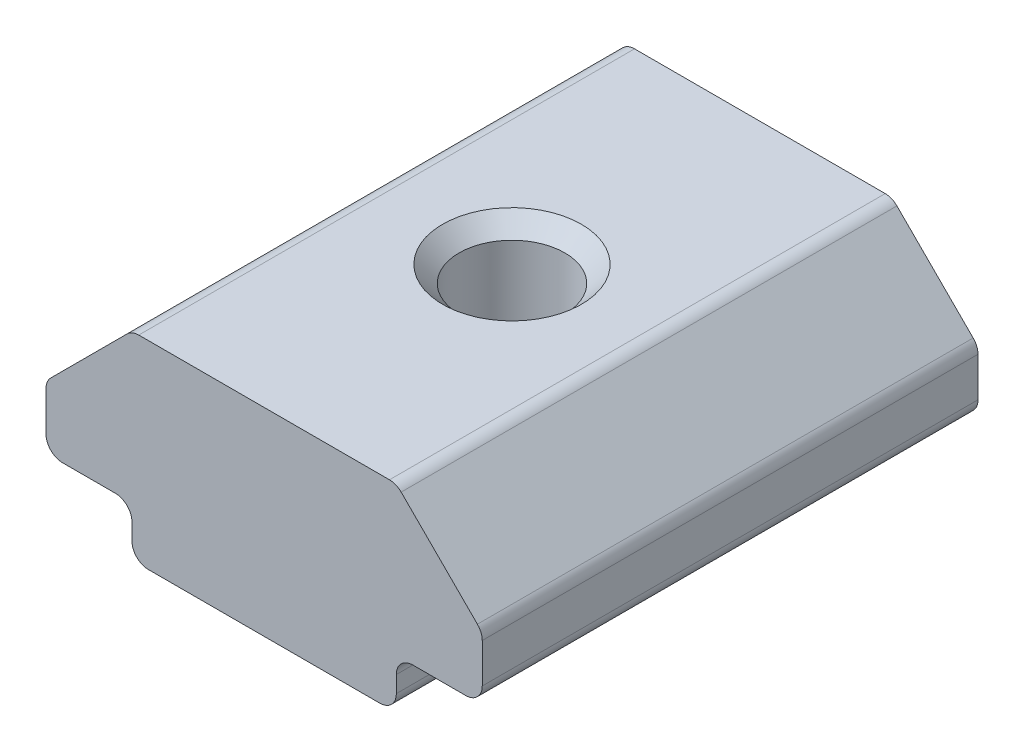
ISO-10303-21;
HEADER;
FILE_DESCRIPTION(('STEP AP214'),'2;1');
FILE_NAME('part.step','',(''),(''),'','','');
FILE_SCHEMA(('AUTOMOTIVE_DESIGN { 1 0 10303 214 1 1 1 1 }'));
ENDSEC;
DATA;
#1=APPLICATION_CONTEXT('core data for automotive mechanical design processes');
#2=APPLICATION_PROTOCOL_DEFINITION('international standard','automotive_design',2000,#1);
#3=PRODUCT_CONTEXT('',#1,'mechanical');
#4=PRODUCT('Part','Part','',(#3));
#5=PRODUCT_RELATED_PRODUCT_CATEGORY('part','',(#4));
#6=PRODUCT_DEFINITION_FORMATION('','',#4);
#7=PRODUCT_DEFINITION_CONTEXT('part definition',#1,'design');
#8=PRODUCT_DEFINITION('design','',#6,#7);
#9=PRODUCT_DEFINITION_SHAPE('','',#8);
#10=(LENGTH_UNIT() NAMED_UNIT(*) SI_UNIT(.MILLI.,.METRE.));
#11=(NAMED_UNIT(*) PLANE_ANGLE_UNIT() SI_UNIT($,.RADIAN.));
#12=(NAMED_UNIT(*) SI_UNIT($,.STERADIAN.) SOLID_ANGLE_UNIT());
#13=UNCERTAINTY_MEASURE_WITH_UNIT(LENGTH_MEASURE(1.E-05),#10,'distance_accuracy_value','');
#14=(GEOMETRIC_REPRESENTATION_CONTEXT(3) GLOBAL_UNCERTAINTY_ASSIGNED_CONTEXT((#13)) GLOBAL_UNIT_ASSIGNED_CONTEXT((#10,
#11,#12)) REPRESENTATION_CONTEXT('',''));
#15=CARTESIAN_POINT('',(0.,0.,0.));
#16=DIRECTION('',(0.,0.,1.));
#17=DIRECTION('',(1.,0.,0.));
#18=AXIS2_PLACEMENT_3D('',#15,#16,#17);
#19=CARTESIAN_POINT('',(-5.75128491827081,2.39950170301745,5.35241694229398));
#20=DIRECTION('',(1.,0.,0.));
#21=DIRECTION('',(0.,0.,-1.));
#22=AXIS2_PLACEMENT_3D('',#19,#20,#21);
#23=PLANE('',#22);
#24=DIRECTION('',(0.,-1.,0.));
#25=VECTOR('',#24,1.);
#26=CARTESIAN_POINT('',(-5.75128491827081,2.39950170301745,5.35241694229398));
#27=LINE('',#26,#25);
#28=CARTESIAN_POINT('',(-5.75128491827081,1.89950170301745,5.35241694229398));
#29=VERTEX_POINT('',#28);
#30=CARTESIAN_POINT('',(-5.75128491827081,1.39950170301745,5.35241694229398));
#31=VERTEX_POINT('',#30);
#32=EDGE_CURVE('E204',#29,#31,#27,.T.);
#33=ORIENTED_EDGE('',*,*,#32,.F.);
#34=DIRECTION('',(0.,0.,-1.));
#35=VECTOR('',#34,1.);
#36=CARTESIAN_POINT('',(-5.75128491827081,1.89950170301745,-9.64758305770602));
#37=LINE('',#36,#35);
#38=CARTESIAN_POINT('',(-5.75128491827081,1.89950170301745,-9.64758305770602));
#39=VERTEX_POINT('',#38);
#40=EDGE_CURVE('E288',#29,#39,#37,.T.);
#41=ORIENTED_EDGE('',*,*,#40,.T.);
#42=DIRECTION('',(0.,-1.,0.));
#43=VECTOR('',#42,1.);
#44=CARTESIAN_POINT('',(-5.75128491827081,2.39950170301745,-9.64758305770602));
#45=LINE('',#44,#43);
#46=CARTESIAN_POINT('',(-5.75128491827081,1.39950170301745,-9.64758305770602));
#47=VERTEX_POINT('',#46);
#48=EDGE_CURVE('E178',#39,#47,#45,.T.);
#49=ORIENTED_EDGE('',*,*,#48,.T.);
#50=DIRECTION('',(0.,0.,-1.));
#51=VECTOR('',#50,1.);
#52=CARTESIAN_POINT('',(-5.75128491827081,1.39950170301745,5.35241694229398));
#53=LINE('',#52,#51);
#54=EDGE_CURVE('E160',#47,#31,#53,.F.);
#55=ORIENTED_EDGE('',*,*,#54,.T.);
#56=EDGE_LOOP('',(#33,#41,#49,#55));
#57=FACE_BOUND('',#56,.T.);
#58=ADVANCED_FACE('F16',(#57),#23,.F.);
#59=CARTESIAN_POINT('',(-5.75128491827081,0.899501703017449,5.35241694229398));
#60=DIRECTION('',(0.,1.,0.));
#61=DIRECTION('',(0.,0.,1.));
#62=AXIS2_PLACEMENT_3D('',#59,#60,#61);
#63=PLANE('',#62);
#64=CARTESIAN_POINT('',(-1.75128491827081,0.899501703017449,-2.14758305770602));
#65=DIRECTION('',(0.,1.,0.));
#66=DIRECTION('',(0.,0.,1.));
#67=AXIS2_PLACEMENT_3D('',#64,#65,#66);
#68=CIRCLE('',#67,2.1);
#69=CARTESIAN_POINT('',(-1.75128491827081,0.899501703017449,-0.0475830577060157));
#70=VERTEX_POINT('',#69);
#71=EDGE_CURVE('E271',#70,#70,#68,.T.);
#72=ORIENTED_EDGE('',*,*,#71,.T.);
#73=EDGE_LOOP('',(#72));
#74=FACE_BOUND('',#73,.T.);
#75=DIRECTION('',(1.,0.,0.));
#76=VECTOR('',#75,1.);
#77=CARTESIAN_POINT('',(-5.75128491827081,0.899501703017449,5.35241694229398));
#78=LINE('',#77,#76);
#79=CARTESIAN_POINT('',(-5.25128491827081,0.899501703017449,5.35241694229398));
#80=VERTEX_POINT('',#79);
#81=CARTESIAN_POINT('',(1.74871508172919,0.899501703017449,5.35241694229398));
#82=VERTEX_POINT('',#81);
#83=EDGE_CURVE('E171',#80,#82,#78,.T.);
#84=ORIENTED_EDGE('',*,*,#83,.F.);
#85=DIRECTION('',(0.,0.,-1.));
#86=VECTOR('',#85,1.);
#87=CARTESIAN_POINT('',(-5.25128491827081,0.899501703017449,5.35241694229398));
#88=LINE('',#87,#86);
#89=CARTESIAN_POINT('',(-5.25128491827081,0.899501703017449,-9.64758305770602));
#90=VERTEX_POINT('',#89);
#91=EDGE_CURVE('E158',#80,#90,#88,.T.);
#92=ORIENTED_EDGE('',*,*,#91,.T.);
#93=DIRECTION('',(1.,0.,0.));
#94=VECTOR('',#93,1.);
#95=CARTESIAN_POINT('',(-5.75128491827081,0.899501703017449,-9.64758305770602));
#96=LINE('',#95,#94);
#97=CARTESIAN_POINT('',(1.74871508172919,0.899501703017449,-9.64758305770602));
#98=VERTEX_POINT('',#97);
#99=EDGE_CURVE('E168',#90,#98,#96,.T.);
#100=ORIENTED_EDGE('',*,*,#99,.T.);
#101=DIRECTION('',(0.,0.,-1.));
#102=VECTOR('',#101,1.);
#103=CARTESIAN_POINT('',(1.74871508172919,0.899501703017449,5.35241694229398));
#104=LINE('',#103,#102);
#105=EDGE_CURVE('E173',#98,#82,#104,.F.);
#106=ORIENTED_EDGE('',*,*,#105,.T.);
#107=EDGE_LOOP('',(#84,#92,#100,#106));
#108=FACE_BOUND('',#107,.T.);
#109=ADVANCED_FACE('F167',(#74,#108),#63,.F.);
#110=CARTESIAN_POINT('',(2.24871508172919,0.899501703017449,5.35241694229398));
#111=DIRECTION('',(-1.,0.,0.));
#112=DIRECTION('',(0.,0.,1.));
#113=AXIS2_PLACEMENT_3D('',#110,#111,#112);
#114=PLANE('',#113);
#115=DIRECTION('',(0.,1.,0.));
#116=VECTOR('',#115,1.);
#117=CARTESIAN_POINT('',(2.24871508172919,0.899501703017449,-9.64758305770602));
#118=LINE('',#117,#116);
#119=CARTESIAN_POINT('',(2.24871508172919,1.39950170301745,-9.64758305770602));
#120=VERTEX_POINT('',#119);
#121=CARTESIAN_POINT('',(2.24871508172919,1.89950170301745,-9.64758305770602));
#122=VERTEX_POINT('',#121);
#123=EDGE_CURVE('E177',#120,#122,#118,.T.);
#124=ORIENTED_EDGE('',*,*,#123,.T.);
#125=DIRECTION('',(0.,0.,-1.));
#126=VECTOR('',#125,1.);
#127=CARTESIAN_POINT('',(2.24871508172919,1.89950170301745,5.35241694229398));
#128=LINE('',#127,#126);
#129=CARTESIAN_POINT('',(2.24871508172919,1.89950170301745,5.35241694229398));
#130=VERTEX_POINT('',#129);
#131=EDGE_CURVE('E286',#122,#130,#128,.F.);
#132=ORIENTED_EDGE('',*,*,#131,.T.);
#133=DIRECTION('',(0.,1.,0.));
#134=VECTOR('',#133,1.);
#135=CARTESIAN_POINT('',(2.24871508172919,0.899501703017449,5.35241694229398));
#136=LINE('',#135,#134);
#137=CARTESIAN_POINT('',(2.24871508172919,1.39950170301745,5.35241694229398));
#138=VERTEX_POINT('',#137);
#139=EDGE_CURVE('E302',#138,#130,#136,.T.);
#140=ORIENTED_EDGE('',*,*,#139,.F.);
#141=DIRECTION('',(0.,0.,-1.));
#142=VECTOR('',#141,1.);
#143=CARTESIAN_POINT('',(2.24871508172919,1.39950170301745,5.35241694229398));
#144=LINE('',#143,#142);
#145=EDGE_CURVE('E268',#138,#120,#144,.T.);
#146=ORIENTED_EDGE('',*,*,#145,.T.);
#147=EDGE_LOOP('',(#124,#132,#140,#146));
#148=FACE_BOUND('',#147,.T.);
#149=ADVANCED_FACE('F315',(#148),#114,.F.);
#150=CARTESIAN_POINT('',(2.24871508172919,2.39950170301745,5.35241694229398));
#151=DIRECTION('',(0.,1.,0.));
#152=DIRECTION('',(0.,0.,1.));
#153=AXIS2_PLACEMENT_3D('',#150,#151,#152);
#154=PLANE('',#153);
#155=DIRECTION('',(1.,0.,0.));
#156=VECTOR('',#155,1.);
#157=CARTESIAN_POINT('',(2.24871508172919,2.39950170301745,5.35241694229398));
#158=LINE('',#157,#156);
#159=CARTESIAN_POINT('',(2.74871508172919,2.39950170301745,5.35241694229398));
#160=VERTEX_POINT('',#159);
#161=CARTESIAN_POINT('',(4.34871508172919,2.39950170301745,5.35241694229398));
#162=VERTEX_POINT('',#161);
#163=EDGE_CURVE('E300',#160,#162,#158,.T.);
#164=ORIENTED_EDGE('',*,*,#163,.F.);
#165=DIRECTION('',(0.,0.,-1.));
#166=VECTOR('',#165,1.);
#167=CARTESIAN_POINT('',(2.74871508172919,2.39950170301745,-9.64758305770602));
#168=LINE('',#167,#166);
#169=CARTESIAN_POINT('',(2.74871508172919,2.39950170301745,-9.64758305770602));
#170=VERTEX_POINT('',#169);
#171=EDGE_CURVE('E283',#160,#170,#168,.T.);
#172=ORIENTED_EDGE('',*,*,#171,.T.);
#173=DIRECTION('',(1.,0.,0.));
#174=VECTOR('',#173,1.);
#175=CARTESIAN_POINT('',(2.24871508172919,2.39950170301745,-9.64758305770602));
#176=LINE('',#175,#174);
#177=CARTESIAN_POINT('',(4.34871508172919,2.39950170301745,-9.64758305770602));
#178=VERTEX_POINT('',#177);
#179=EDGE_CURVE('E181',#170,#178,#176,.T.);
#180=ORIENTED_EDGE('',*,*,#179,.T.);
#181=DIRECTION('',(0.,0.,-1.));
#182=VECTOR('',#181,1.);
#183=CARTESIAN_POINT('',(4.34871508172919,2.39950170301745,5.35241694229398));
#184=LINE('',#183,#182);
#185=EDGE_CURVE('E265',#178,#162,#184,.F.);
#186=ORIENTED_EDGE('',*,*,#185,.T.);
#187=EDGE_LOOP('',(#164,#172,#180,#186));
#188=FACE_BOUND('',#187,.T.);
#189=ADVANCED_FACE('F307',(#188),#154,.F.);
#190=CARTESIAN_POINT('',(4.84871508172919,2.39950170301745,5.35241694229398));
#191=DIRECTION('',(-1.,0.,0.));
#192=DIRECTION('',(0.,0.,1.));
#193=AXIS2_PLACEMENT_3D('',#190,#191,#192);
#194=PLANE('',#193);
#195=DIRECTION('',(0.,1.,0.));
#196=VECTOR('',#195,1.);
#197=CARTESIAN_POINT('',(4.84871508172919,2.39950170301745,-9.64758305770602));
#198=LINE('',#197,#196);
#199=CARTESIAN_POINT('',(4.84871508172919,2.89950170301745,-9.64758305770602));
#200=VERTEX_POINT('',#199);
#201=CARTESIAN_POINT('',(4.84871508172919,4.09239492183091,-9.64758305770602));
#202=VERTEX_POINT('',#201);
#203=EDGE_CURVE('E187',#200,#202,#198,.T.);
#204=ORIENTED_EDGE('',*,*,#203,.T.);
#205=DIRECTION('',(0.,0.,-1.));
#206=VECTOR('',#205,1.);
#207=CARTESIAN_POINT('',(4.84871508172919,4.09239492183091,5.35241694229398));
#208=LINE('',#207,#206);
#209=CARTESIAN_POINT('',(4.84871508172919,4.09239492183091,5.35241694229398));
#210=VERTEX_POINT('',#209);
#211=EDGE_CURVE('E263',#202,#210,#208,.F.);
#212=ORIENTED_EDGE('',*,*,#211,.T.);
#213=DIRECTION('',(0.,1.,0.));
#214=VECTOR('',#213,1.);
#215=CARTESIAN_POINT('',(4.84871508172919,2.39950170301745,5.35241694229398));
#216=LINE('',#215,#214);
#217=CARTESIAN_POINT('',(4.84871508172919,2.89950170301745,5.35241694229398));
#218=VERTEX_POINT('',#217);
#219=EDGE_CURVE('E311',#218,#210,#216,.T.);
#220=ORIENTED_EDGE('',*,*,#219,.F.);
#221=DIRECTION('',(0.,0.,-1.));
#222=VECTOR('',#221,1.);
#223=CARTESIAN_POINT('',(4.84871508172919,2.89950170301745,5.35241694229398));
#224=LINE('',#223,#222);
#225=EDGE_CURVE('E260',#218,#200,#224,.T.);
#226=ORIENTED_EDGE('',*,*,#225,.T.);
#227=EDGE_LOOP('',(#204,#212,#220,#226));
#228=FACE_BOUND('',#227,.T.);
#229=ADVANCED_FACE('F541',(#228),#194,.F.);
#230=CARTESIAN_POINT('',(4.84871508172919,4.29950170301746,5.35241694229398));
#231=DIRECTION('',(-0.707106781186546,-0.707106781186549,0.));
#232=DIRECTION('',(0.707106781186549,-0.707106781186546,0.));
#233=AXIS2_PLACEMENT_3D('',#230,#231,#232);
#234=PLANE('',#233);
#235=DIRECTION('',(-0.707106781186549,0.707106781186546,0.));
#236=VECTOR('',#235,1.);
#237=CARTESIAN_POINT('',(4.84871508172919,4.29950170301746,-9.64758305770602));
#238=LINE('',#237,#236);
#239=CARTESIAN_POINT('',(4.70226847232246,4.44594831242419,-9.64758305770602));
#240=VERTEX_POINT('',#239);
#241=CARTESIAN_POINT('',(2.39516169113591,6.75305509361072,-9.64758305770602));
#242=VERTEX_POINT('',#241);
#243=EDGE_CURVE('E190',#240,#242,#238,.T.);
#244=ORIENTED_EDGE('',*,*,#243,.T.);
#245=DIRECTION('',(0.,0.,-1.));
#246=VECTOR('',#245,1.);
#247=CARTESIAN_POINT('',(2.39516169113591,6.75305509361072,5.35241694229398));
#248=LINE('',#247,#246);
#249=CARTESIAN_POINT('',(2.39516169113591,6.75305509361072,5.35241694229398));
#250=VERTEX_POINT('',#249);
#251=EDGE_CURVE('E258',#242,#250,#248,.F.);
#252=ORIENTED_EDGE('',*,*,#251,.T.);
#253=DIRECTION('',(-0.707106781186549,0.707106781186546,0.));
#254=VECTOR('',#253,1.);
#255=CARTESIAN_POINT('',(4.84871508172919,4.29950170301746,5.35241694229398));
#256=LINE('',#255,#254);
#257=CARTESIAN_POINT('',(4.70226847232246,4.44594831242419,5.35241694229398));
#258=VERTEX_POINT('',#257);
#259=EDGE_CURVE('E326',#258,#250,#256,.T.);
#260=ORIENTED_EDGE('',*,*,#259,.F.);
#261=DIRECTION('',(0.,0.,-1.));
#262=VECTOR('',#261,1.);
#263=CARTESIAN_POINT('',(4.70226847232246,4.44594831242419,5.35241694229398));
#264=LINE('',#263,#262);
#265=EDGE_CURVE('E255',#258,#240,#264,.T.);
#266=ORIENTED_EDGE('',*,*,#265,.T.);
#267=EDGE_LOOP('',(#244,#252,#260,#266));
#268=FACE_BOUND('',#267,.T.);
#269=ADVANCED_FACE('F531',(#268),#234,.F.);
#270=CARTESIAN_POINT('',(2.24871508172919,6.89950170301745,5.35241694229398));
#271=DIRECTION('',(0.,-1.,0.));
#272=DIRECTION('',(0.,0.,-1.));
#273=AXIS2_PLACEMENT_3D('',#270,#271,#272);
#274=PLANE('',#273);
#275=CARTESIAN_POINT('',(-1.75128491827081,6.89950170301745,-2.14758305770602));
#276=DIRECTION('',(0.,-1.,0.));
#277=DIRECTION('',(0.,0.,-1.));
#278=AXIS2_PLACEMENT_3D('',#275,#276,#277);
#279=CIRCLE('',#278,2.1);
#280=CARTESIAN_POINT('',(-1.75128491827081,6.89950170301745,-4.24758305770601));
#281=VERTEX_POINT('',#280);
#282=EDGE_CURVE('E280',#281,#281,#279,.T.);
#283=ORIENTED_EDGE('',*,*,#282,.T.);
#284=EDGE_LOOP('',(#283));
#285=FACE_BOUND('',#284,.T.);
#286=DIRECTION('',(-1.,0.,0.));
#287=VECTOR('',#286,1.);
#288=CARTESIAN_POINT('',(2.24871508172919,6.89950170301745,-9.64758305770602));
#289=LINE('',#288,#287);
#290=CARTESIAN_POINT('',(2.04160830054264,6.89950170301745,-9.64758305770602));
#291=VERTEX_POINT('',#290);
#292=CARTESIAN_POINT('',(-5.54417813708426,6.89950170301745,-9.64758305770602));
#293=VERTEX_POINT('',#292);
#294=EDGE_CURVE('E193',#291,#293,#289,.T.);
#295=ORIENTED_EDGE('',*,*,#294,.T.);
#296=DIRECTION('',(0.,0.,-1.));
#297=VECTOR('',#296,1.);
#298=CARTESIAN_POINT('',(-5.54417813708426,6.89950170301745,5.35241694229398));
#299=LINE('',#298,#297);
#300=CARTESIAN_POINT('',(-5.54417813708426,6.89950170301745,5.35241694229398));
#301=VERTEX_POINT('',#300);
#302=EDGE_CURVE('E253',#293,#301,#299,.F.);
#303=ORIENTED_EDGE('',*,*,#302,.T.);
#304=DIRECTION('',(-1.,0.,0.));
#305=VECTOR('',#304,1.);
#306=CARTESIAN_POINT('',(2.24871508172919,6.89950170301745,5.35241694229398));
#307=LINE('',#306,#305);
#308=CARTESIAN_POINT('',(2.04160830054264,6.89950170301745,5.35241694229398));
#309=VERTEX_POINT('',#308);
#310=EDGE_CURVE('E329',#309,#301,#307,.T.);
#311=ORIENTED_EDGE('',*,*,#310,.F.);
#312=DIRECTION('',(0.,0.,-1.));
#313=VECTOR('',#312,1.);
#314=CARTESIAN_POINT('',(2.04160830054264,6.89950170301745,5.35241694229398));
#315=LINE('',#314,#313);
#316=EDGE_CURVE('E250',#309,#291,#315,.T.);
#317=ORIENTED_EDGE('',*,*,#316,.T.);
#318=EDGE_LOOP('',(#295,#303,#311,#317));
#319=FACE_BOUND('',#318,.T.);
#320=ADVANCED_FACE('F521',(#285,#319),#274,.F.);
#321=CARTESIAN_POINT('',(-8.35128491827081,4.29950170301746,5.35241694229398));
#322=DIRECTION('',(0.707106781186546,-0.707106781186549,0.));
#323=DIRECTION('',(0.707106781186549,0.707106781186546,0.));
#324=AXIS2_PLACEMENT_3D('',#321,#322,#323);
#325=PLANE('',#324);
#326=DIRECTION('',(-0.707106781186549,-0.707106781186546,0.));
#327=VECTOR('',#326,1.);
#328=CARTESIAN_POINT('',(-8.35128491827081,4.29950170301746,-9.64758305770602));
#329=LINE('',#328,#327);
#330=CARTESIAN_POINT('',(-5.89773152767754,6.75305509361072,-9.64758305770602));
#331=VERTEX_POINT('',#330);
#332=CARTESIAN_POINT('',(-8.20483830886409,4.44594831242418,-9.64758305770602));
#333=VERTEX_POINT('',#332);
#334=EDGE_CURVE('E196',#331,#333,#329,.T.);
#335=ORIENTED_EDGE('',*,*,#334,.T.);
#336=DIRECTION('',(0.,0.,-1.));
#337=VECTOR('',#336,1.);
#338=CARTESIAN_POINT('',(-8.20483830886409,4.44594831242418,5.35241694229398));
#339=LINE('',#338,#337);
#340=CARTESIAN_POINT('',(-8.20483830886409,4.44594831242418,5.35241694229398));
#341=VERTEX_POINT('',#340);
#342=EDGE_CURVE('E248',#333,#341,#339,.F.);
#343=ORIENTED_EDGE('',*,*,#342,.T.);
#344=DIRECTION('',(-0.707106781186549,-0.707106781186546,0.));
#345=VECTOR('',#344,1.);
#346=CARTESIAN_POINT('',(-8.35128491827081,4.29950170301746,5.35241694229398));
#347=LINE('',#346,#345);
#348=CARTESIAN_POINT('',(-5.89773152767754,6.75305509361072,5.35241694229398));
#349=VERTEX_POINT('',#348);
#350=EDGE_CURVE('E332',#349,#341,#347,.T.);
#351=ORIENTED_EDGE('',*,*,#350,.F.);
#352=DIRECTION('',(0.,0.,-1.));
#353=VECTOR('',#352,1.);
#354=CARTESIAN_POINT('',(-5.89773152767754,6.75305509361072,5.35241694229398));
#355=LINE('',#354,#353);
#356=EDGE_CURVE('E245',#349,#331,#355,.T.);
#357=ORIENTED_EDGE('',*,*,#356,.T.);
#358=EDGE_LOOP('',(#335,#343,#351,#357));
#359=FACE_BOUND('',#358,.T.);
#360=ADVANCED_FACE('F511',(#359),#325,.F.);
#361=CARTESIAN_POINT('',(-8.35128491827081,2.39950170301745,5.35241694229398));
#362=DIRECTION('',(1.,0.,0.));
#363=DIRECTION('',(0.,0.,-1.));
#364=AXIS2_PLACEMENT_3D('',#361,#362,#363);
#365=PLANE('',#364);
#366=DIRECTION('',(0.,-1.,0.));
#367=VECTOR('',#366,1.);
#368=CARTESIAN_POINT('',(-8.35128491827081,2.39950170301745,-9.64758305770602));
#369=LINE('',#368,#367);
#370=CARTESIAN_POINT('',(-8.35128491827081,4.09239492183091,-9.64758305770602));
#371=VERTEX_POINT('',#370);
#372=CARTESIAN_POINT('',(-8.35128491827081,2.89950170301745,-9.64758305770602));
#373=VERTEX_POINT('',#372);
#374=EDGE_CURVE('E199',#371,#373,#369,.T.);
#375=ORIENTED_EDGE('',*,*,#374,.T.);
#376=DIRECTION('',(0.,0.,-1.));
#377=VECTOR('',#376,1.);
#378=CARTESIAN_POINT('',(-8.35128491827081,2.89950170301745,5.35241694229398));
#379=LINE('',#378,#377);
#380=CARTESIAN_POINT('',(-8.35128491827081,2.89950170301745,5.35241694229398));
#381=VERTEX_POINT('',#380);
#382=EDGE_CURVE('E243',#373,#381,#379,.F.);
#383=ORIENTED_EDGE('',*,*,#382,.T.);
#384=DIRECTION('',(0.,-1.,0.));
#385=VECTOR('',#384,1.);
#386=CARTESIAN_POINT('',(-8.35128491827081,2.39950170301745,5.35241694229398));
#387=LINE('',#386,#385);
#388=CARTESIAN_POINT('',(-8.35128491827081,4.09239492183091,5.35241694229398));
#389=VERTEX_POINT('',#388);
#390=EDGE_CURVE('E335',#389,#381,#387,.T.);
#391=ORIENTED_EDGE('',*,*,#390,.F.);
#392=DIRECTION('',(0.,0.,-1.));
#393=VECTOR('',#392,1.);
#394=CARTESIAN_POINT('',(-8.35128491827081,4.09239492183091,5.35241694229398));
#395=LINE('',#394,#393);
#396=EDGE_CURVE('E240',#389,#371,#395,.T.);
#397=ORIENTED_EDGE('',*,*,#396,.T.);
#398=EDGE_LOOP('',(#375,#383,#391,#397));
#399=FACE_BOUND('',#398,.T.);
#400=ADVANCED_FACE('F502',(#399),#365,.F.);
#401=CARTESIAN_POINT('',(-8.35128491827081,2.39950170301745,5.35241694229398));
#402=DIRECTION('',(0.,1.,0.));
#403=DIRECTION('',(0.,0.,1.));
#404=AXIS2_PLACEMENT_3D('',#401,#402,#403);
#405=PLANE('',#404);
#406=DIRECTION('',(1.,0.,0.));
#407=VECTOR('',#406,1.);
#408=CARTESIAN_POINT('',(-8.35128491827081,2.39950170301745,-9.64758305770602));
#409=LINE('',#408,#407);
#410=CARTESIAN_POINT('',(-7.85128491827081,2.39950170301745,-9.64758305770602));
#411=VERTEX_POINT('',#410);
#412=CARTESIAN_POINT('',(-6.25128491827081,2.39950170301745,-9.64758305770602));
#413=VERTEX_POINT('',#412);
#414=EDGE_CURVE('E202',#411,#413,#409,.T.);
#415=ORIENTED_EDGE('',*,*,#414,.T.);
#416=DIRECTION('',(0.,0.,-1.));
#417=VECTOR('',#416,1.);
#418=CARTESIAN_POINT('',(-6.25128491827081,2.39950170301745,5.35241694229398));
#419=LINE('',#418,#417);
#420=CARTESIAN_POINT('',(-6.25128491827081,2.39950170301745,5.35241694229398));
#421=VERTEX_POINT('',#420);
#422=EDGE_CURVE('E37',#413,#421,#419,.F.);
#423=ORIENTED_EDGE('',*,*,#422,.T.);
#424=DIRECTION('',(1.,0.,0.));
#425=VECTOR('',#424,1.);
#426=CARTESIAN_POINT('',(-8.35128491827081,2.39950170301745,5.35241694229398));
#427=LINE('',#426,#425);
#428=CARTESIAN_POINT('',(-7.85128491827081,2.39950170301745,5.35241694229398));
#429=VERTEX_POINT('',#428);
#430=EDGE_CURVE('E205',#429,#421,#427,.T.);
#431=ORIENTED_EDGE('',*,*,#430,.F.);
#432=DIRECTION('',(0.,0.,-1.));
#433=VECTOR('',#432,1.);
#434=CARTESIAN_POINT('',(-7.85128491827081,2.39950170301745,5.35241694229398));
#435=LINE('',#434,#433);
#436=EDGE_CURVE('E237',#429,#411,#435,.T.);
#437=ORIENTED_EDGE('',*,*,#436,.T.);
#438=EDGE_LOOP('',(#415,#423,#431,#437));
#439=FACE_BOUND('',#438,.T.);
#440=ADVANCED_FACE('F493',(#439),#405,.F.);
#441=CARTESIAN_POINT('',(-1.75128491827081,0.899501703017449,5.35241694229398));
#442=DIRECTION('',(0.,0.,1.));
#443=DIRECTION('',(1.,0.,0.));
#444=AXIS2_PLACEMENT_3D('',#441,#442,#443);
#445=PLANE('',#444);
#446=ORIENTED_EDGE('',*,*,#430,.T.);
#447=CARTESIAN_POINT('',(-6.25128491827081,1.89950170301745,5.35241694229398));
#448=DIRECTION('',(0.,0.,1.));
#449=DIRECTION('',(1.,0.,0.));
#450=AXIS2_PLACEMENT_3D('',#447,#448,#449);
#451=CIRCLE('',#450,0.5);
#452=EDGE_CURVE('E10',#421,#29,#451,.F.);
#453=ORIENTED_EDGE('',*,*,#452,.T.);
#454=ORIENTED_EDGE('',*,*,#32,.T.);
#455=CARTESIAN_POINT('',(-5.25128491827081,1.39950170301745,5.35241694229398));
#456=DIRECTION('',(0.,0.,1.));
#457=DIRECTION('',(1.,0.,0.));
#458=AXIS2_PLACEMENT_3D('',#455,#456,#457);
#459=CIRCLE('',#458,0.5);
#460=EDGE_CURVE('E235',#31,#80,#459,.T.);
#461=ORIENTED_EDGE('',*,*,#460,.T.);
#462=ORIENTED_EDGE('',*,*,#83,.T.);
#463=CARTESIAN_POINT('',(1.74871508172919,1.39950170301745,5.35241694229398));
#464=DIRECTION('',(0.,0.,1.));
#465=DIRECTION('',(1.,0.,0.));
#466=AXIS2_PLACEMENT_3D('',#463,#464,#465);
#467=CIRCLE('',#466,0.5);
#468=EDGE_CURVE('E221',#82,#138,#467,.T.);
#469=ORIENTED_EDGE('',*,*,#468,.T.);
#470=ORIENTED_EDGE('',*,*,#139,.T.);
#471=CARTESIAN_POINT('',(2.74871508172919,1.89950170301745,5.35241694229398));
#472=DIRECTION('',(0.,0.,1.));
#473=DIRECTION('',(1.,0.,0.));
#474=AXIS2_PLACEMENT_3D('',#471,#472,#473);
#475=CIRCLE('',#474,0.5);
#476=EDGE_CURVE('E294',#130,#160,#475,.F.);
#477=ORIENTED_EDGE('',*,*,#476,.T.);
#478=ORIENTED_EDGE('',*,*,#163,.T.);
#479=CARTESIAN_POINT('',(4.34871508172919,2.89950170301745,5.35241694229398));
#480=DIRECTION('',(0.,0.,1.));
#481=DIRECTION('',(1.,0.,0.));
#482=AXIS2_PLACEMENT_3D('',#479,#480,#481);
#483=CIRCLE('',#482,0.5);
#484=EDGE_CURVE('E223',#162,#218,#483,.T.);
#485=ORIENTED_EDGE('',*,*,#484,.T.);
#486=ORIENTED_EDGE('',*,*,#219,.T.);
#487=CARTESIAN_POINT('',(4.34871508172919,4.09239492183091,5.35241694229398));
#488=DIRECTION('',(0.,0.,1.));
#489=DIRECTION('',(1.,0.,0.));
#490=AXIS2_PLACEMENT_3D('',#487,#488,#489);
#491=CIRCLE('',#490,0.5);
#492=EDGE_CURVE('E225',#210,#258,#491,.T.);
#493=ORIENTED_EDGE('',*,*,#492,.T.);
#494=ORIENTED_EDGE('',*,*,#259,.T.);
#495=CARTESIAN_POINT('',(2.04160830054264,6.39950170301745,5.35241694229398));
#496=DIRECTION('',(0.,0.,1.));
#497=DIRECTION('',(1.,0.,0.));
#498=AXIS2_PLACEMENT_3D('',#495,#496,#497);
#499=CIRCLE('',#498,0.5);
#500=EDGE_CURVE('E227',#250,#309,#499,.T.);
#501=ORIENTED_EDGE('',*,*,#500,.T.);
#502=ORIENTED_EDGE('',*,*,#310,.T.);
#503=CARTESIAN_POINT('',(-5.54417813708426,6.39950170301745,5.35241694229398));
#504=DIRECTION('',(0.,0.,1.));
#505=DIRECTION('',(1.,0.,0.));
#506=AXIS2_PLACEMENT_3D('',#503,#504,#505);
#507=CIRCLE('',#506,0.5);
#508=EDGE_CURVE('E229',#301,#349,#507,.T.);
#509=ORIENTED_EDGE('',*,*,#508,.T.);
#510=ORIENTED_EDGE('',*,*,#350,.T.);
#511=CARTESIAN_POINT('',(-7.85128491827081,4.09239492183091,5.35241694229398));
#512=DIRECTION('',(0.,0.,1.));
#513=DIRECTION('',(1.,0.,0.));
#514=AXIS2_PLACEMENT_3D('',#511,#512,#513);
#515=CIRCLE('',#514,0.5);
#516=EDGE_CURVE('E231',#341,#389,#515,.T.);
#517=ORIENTED_EDGE('',*,*,#516,.T.);
#518=ORIENTED_EDGE('',*,*,#390,.T.);
#519=CARTESIAN_POINT('',(-7.85128491827081,2.89950170301745,5.35241694229398));
#520=DIRECTION('',(0.,0.,1.));
#521=DIRECTION('',(1.,0.,0.));
#522=AXIS2_PLACEMENT_3D('',#519,#520,#521);
#523=CIRCLE('',#522,0.5);
#524=EDGE_CURVE('E233',#381,#429,#523,.T.);
#525=ORIENTED_EDGE('',*,*,#524,.T.);
#526=EDGE_LOOP('',(#446,#453,#454,#461,#462,#469,#470,#477,#478,#485,#486,#493,#494,#501,#502,
#509,#510,#517,#518,#525));
#527=FACE_BOUND('',#526,.T.);
#528=ADVANCED_FACE('F299',(#527),#445,.T.);
#529=CARTESIAN_POINT('',(-1.75128491827081,0.899501703017449,-9.64758305770602));
#530=DIRECTION('',(0.,0.,1.));
#531=DIRECTION('',(1.,0.,0.));
#532=AXIS2_PLACEMENT_3D('',#529,#530,#531);
#533=PLANE('',#532);
#534=ORIENTED_EDGE('',*,*,#99,.F.);
#535=CARTESIAN_POINT('',(-5.25128491827081,1.39950170301745,-9.64758305770602));
#536=DIRECTION('',(0.,0.,1.));
#537=DIRECTION('',(1.,0.,0.));
#538=AXIS2_PLACEMENT_3D('',#535,#536,#537);
#539=CIRCLE('',#538,0.5);
#540=EDGE_CURVE('E154',#90,#47,#539,.F.);
#541=ORIENTED_EDGE('',*,*,#540,.T.);
#542=ORIENTED_EDGE('',*,*,#48,.F.);
#543=CARTESIAN_POINT('',(-6.25128491827081,1.89950170301745,-9.64758305770602));
#544=DIRECTION('',(0.,0.,1.));
#545=DIRECTION('',(1.,0.,0.));
#546=AXIS2_PLACEMENT_3D('',#543,#544,#545);
#547=CIRCLE('',#546,0.5);
#548=EDGE_CURVE('E24',#39,#413,#547,.T.);
#549=ORIENTED_EDGE('',*,*,#548,.T.);
#550=ORIENTED_EDGE('',*,*,#414,.F.);
#551=CARTESIAN_POINT('',(-7.85128491827081,2.89950170301745,-9.64758305770602));
#552=DIRECTION('',(0.,0.,1.));
#553=DIRECTION('',(1.,0.,0.));
#554=AXIS2_PLACEMENT_3D('',#551,#552,#553);
#555=CIRCLE('',#554,0.5);
#556=EDGE_CURVE('E162',#411,#373,#555,.F.);
#557=ORIENTED_EDGE('',*,*,#556,.T.);
#558=ORIENTED_EDGE('',*,*,#374,.F.);
#559=CARTESIAN_POINT('',(-7.85128491827081,4.09239492183091,-9.64758305770602));
#560=DIRECTION('',(0.,0.,1.));
#561=DIRECTION('',(1.,0.,0.));
#562=AXIS2_PLACEMENT_3D('',#559,#560,#561);
#563=CIRCLE('',#562,0.5);
#564=EDGE_CURVE('E217',#371,#333,#563,.F.);
#565=ORIENTED_EDGE('',*,*,#564,.T.);
#566=ORIENTED_EDGE('',*,*,#334,.F.);
#567=CARTESIAN_POINT('',(-5.54417813708426,6.39950170301745,-9.64758305770602));
#568=DIRECTION('',(0.,0.,1.));
#569=DIRECTION('',(1.,0.,0.));
#570=AXIS2_PLACEMENT_3D('',#567,#568,#569);
#571=CIRCLE('',#570,0.5);
#572=EDGE_CURVE('E215',#331,#293,#571,.F.);
#573=ORIENTED_EDGE('',*,*,#572,.T.);
#574=ORIENTED_EDGE('',*,*,#294,.F.);
#575=CARTESIAN_POINT('',(2.04160830054264,6.39950170301745,-9.64758305770602));
#576=DIRECTION('',(0.,0.,1.));
#577=DIRECTION('',(1.,0.,0.));
#578=AXIS2_PLACEMENT_3D('',#575,#576,#577);
#579=CIRCLE('',#578,0.5);
#580=EDGE_CURVE('E213',#291,#242,#579,.F.);
#581=ORIENTED_EDGE('',*,*,#580,.T.);
#582=ORIENTED_EDGE('',*,*,#243,.F.);
#583=CARTESIAN_POINT('',(4.34871508172919,4.09239492183091,-9.64758305770602));
#584=DIRECTION('',(0.,0.,1.));
#585=DIRECTION('',(1.,0.,0.));
#586=AXIS2_PLACEMENT_3D('',#583,#584,#585);
#587=CIRCLE('',#586,0.5);
#588=EDGE_CURVE('E211',#240,#202,#587,.F.);
#589=ORIENTED_EDGE('',*,*,#588,.T.);
#590=ORIENTED_EDGE('',*,*,#203,.F.);
#591=CARTESIAN_POINT('',(4.34871508172919,2.89950170301745,-9.64758305770602));
#592=DIRECTION('',(0.,0.,1.));
#593=DIRECTION('',(1.,0.,0.));
#594=AXIS2_PLACEMENT_3D('',#591,#592,#593);
#595=CIRCLE('',#594,0.5);
#596=EDGE_CURVE('E208',#200,#178,#595,.F.);
#597=ORIENTED_EDGE('',*,*,#596,.T.);
#598=ORIENTED_EDGE('',*,*,#179,.F.);
#599=CARTESIAN_POINT('',(2.74871508172919,1.89950170301745,-9.64758305770602));
#600=DIRECTION('',(0.,0.,1.));
#601=DIRECTION('',(1.,0.,0.));
#602=AXIS2_PLACEMENT_3D('',#599,#600,#601);
#603=CIRCLE('',#602,0.5);
#604=EDGE_CURVE('E292',#170,#122,#603,.T.);
#605=ORIENTED_EDGE('',*,*,#604,.T.);
#606=ORIENTED_EDGE('',*,*,#123,.F.);
#607=CARTESIAN_POINT('',(1.74871508172919,1.39950170301745,-9.64758305770602));
#608=DIRECTION('',(0.,0.,1.));
#609=DIRECTION('',(1.,0.,0.));
#610=AXIS2_PLACEMENT_3D('',#607,#608,#609);
#611=CIRCLE('',#610,0.5);
#612=EDGE_CURVE('E172',#120,#98,#611,.F.);
#613=ORIENTED_EDGE('',*,*,#612,.T.);
#614=EDGE_LOOP('',(#534,#541,#542,#549,#550,#557,#558,#565,#566,#573,#574,#581,#582,#589,#590,
#597,#598,#605,#606,#613));
#615=FACE_BOUND('',#614,.T.);
#616=ADVANCED_FACE('F175',(#615),#533,.F.);
#617=CARTESIAN_POINT('',(-5.25128491827081,1.39950170301745,5.35241694229398));
#618=DIRECTION('',(0.,0.,-1.));
#619=DIRECTION('',(-1.,0.,0.));
#620=AXIS2_PLACEMENT_3D('',#617,#618,#619);
#621=CYLINDRICAL_SURFACE('',#620,0.5);
#622=ORIENTED_EDGE('',*,*,#460,.F.);
#623=ORIENTED_EDGE('',*,*,#54,.F.);
#624=ORIENTED_EDGE('',*,*,#540,.F.);
#625=ORIENTED_EDGE('',*,*,#91,.F.);
#626=EDGE_LOOP('',(#622,#623,#624,#625));
#627=FACE_BOUND('',#626,.T.);
#628=ADVANCED_FACE('F157',(#627),#621,.T.);
#629=CARTESIAN_POINT('',(-7.85128491827081,2.89950170301745,5.35241694229398));
#630=DIRECTION('',(0.,0.,-1.));
#631=DIRECTION('',(-1.,0.,0.));
#632=AXIS2_PLACEMENT_3D('',#629,#630,#631);
#633=CYLINDRICAL_SURFACE('',#632,0.5);
#634=ORIENTED_EDGE('',*,*,#524,.F.);
#635=ORIENTED_EDGE('',*,*,#382,.F.);
#636=ORIENTED_EDGE('',*,*,#556,.F.);
#637=ORIENTED_EDGE('',*,*,#436,.F.);
#638=EDGE_LOOP('',(#634,#635,#636,#637));
#639=FACE_BOUND('',#638,.T.);
#640=ADVANCED_FACE('F356',(#639),#633,.T.);
#641=CARTESIAN_POINT('',(-7.85128491827081,4.09239492183091,5.35241694229398));
#642=DIRECTION('',(0.,0.,-1.));
#643=DIRECTION('',(-1.,0.,0.));
#644=AXIS2_PLACEMENT_3D('',#641,#642,#643);
#645=CYLINDRICAL_SURFACE('',#644,0.5);
#646=ORIENTED_EDGE('',*,*,#516,.F.);
#647=ORIENTED_EDGE('',*,*,#342,.F.);
#648=ORIENTED_EDGE('',*,*,#564,.F.);
#649=ORIENTED_EDGE('',*,*,#396,.F.);
#650=EDGE_LOOP('',(#646,#647,#648,#649));
#651=FACE_BOUND('',#650,.T.);
#652=ADVANCED_FACE('F359',(#651),#645,.T.);
#653=CARTESIAN_POINT('',(-5.54417813708426,6.39950170301745,5.35241694229398));
#654=DIRECTION('',(0.,0.,-1.));
#655=DIRECTION('',(-1.,0.,0.));
#656=AXIS2_PLACEMENT_3D('',#653,#654,#655);
#657=CYLINDRICAL_SURFACE('',#656,0.5);
#658=ORIENTED_EDGE('',*,*,#508,.F.);
#659=ORIENTED_EDGE('',*,*,#302,.F.);
#660=ORIENTED_EDGE('',*,*,#572,.F.);
#661=ORIENTED_EDGE('',*,*,#356,.F.);
#662=EDGE_LOOP('',(#658,#659,#660,#661));
#663=FACE_BOUND('',#662,.T.);
#664=ADVANCED_FACE('F363',(#663),#657,.T.);
#665=CARTESIAN_POINT('',(2.04160830054264,6.39950170301745,5.35241694229398));
#666=DIRECTION('',(0.,0.,-1.));
#667=DIRECTION('',(-1.,0.,0.));
#668=AXIS2_PLACEMENT_3D('',#665,#666,#667);
#669=CYLINDRICAL_SURFACE('',#668,0.5);
#670=ORIENTED_EDGE('',*,*,#500,.F.);
#671=ORIENTED_EDGE('',*,*,#251,.F.);
#672=ORIENTED_EDGE('',*,*,#580,.F.);
#673=ORIENTED_EDGE('',*,*,#316,.F.);
#674=EDGE_LOOP('',(#670,#671,#672,#673));
#675=FACE_BOUND('',#674,.T.);
#676=ADVANCED_FACE('F367',(#675),#669,.T.);
#677=CARTESIAN_POINT('',(4.34871508172919,4.09239492183091,5.35241694229398));
#678=DIRECTION('',(0.,0.,-1.));
#679=DIRECTION('',(-1.,0.,0.));
#680=AXIS2_PLACEMENT_3D('',#677,#678,#679);
#681=CYLINDRICAL_SURFACE('',#680,0.5);
#682=ORIENTED_EDGE('',*,*,#492,.F.);
#683=ORIENTED_EDGE('',*,*,#211,.F.);
#684=ORIENTED_EDGE('',*,*,#588,.F.);
#685=ORIENTED_EDGE('',*,*,#265,.F.);
#686=EDGE_LOOP('',(#682,#683,#684,#685));
#687=FACE_BOUND('',#686,.T.);
#688=ADVANCED_FACE('F371',(#687),#681,.T.);
#689=CARTESIAN_POINT('',(4.34871508172919,2.89950170301745,5.35241694229398));
#690=DIRECTION('',(0.,0.,-1.));
#691=DIRECTION('',(-1.,0.,0.));
#692=AXIS2_PLACEMENT_3D('',#689,#690,#691);
#693=CYLINDRICAL_SURFACE('',#692,0.5);
#694=ORIENTED_EDGE('',*,*,#484,.F.);
#695=ORIENTED_EDGE('',*,*,#185,.F.);
#696=ORIENTED_EDGE('',*,*,#596,.F.);
#697=ORIENTED_EDGE('',*,*,#225,.F.);
#698=EDGE_LOOP('',(#694,#695,#696,#697));
#699=FACE_BOUND('',#698,.T.);
#700=ADVANCED_FACE('F375',(#699),#693,.T.);
#701=CARTESIAN_POINT('',(1.74871508172919,1.39950170301745,5.35241694229398));
#702=DIRECTION('',(0.,0.,-1.));
#703=DIRECTION('',(-1.,0.,0.));
#704=AXIS2_PLACEMENT_3D('',#701,#702,#703);
#705=CYLINDRICAL_SURFACE('',#704,0.5);
#706=ORIENTED_EDGE('',*,*,#468,.F.);
#707=ORIENTED_EDGE('',*,*,#105,.F.);
#708=ORIENTED_EDGE('',*,*,#612,.F.);
#709=ORIENTED_EDGE('',*,*,#145,.F.);
#710=EDGE_LOOP('',(#706,#707,#708,#709));
#711=FACE_BOUND('',#710,.T.);
#712=ADVANCED_FACE('F319',(#711),#705,.T.);
#713=CARTESIAN_POINT('',(-1.75128491827081,0.899501703017449,-2.14758305770602));
#714=DIRECTION('',(0.,1.,0.));
#715=DIRECTION('',(0.,0.,1.));
#716=AXIS2_PLACEMENT_3D('',#713,#714,#715);
#717=CYLINDRICAL_SURFACE('',#716,1.6);
#718=CARTESIAN_POINT('',(-1.75128491827081,1.39950170301745,-2.14758305770602));
#719=DIRECTION('',(0.,1.,0.));
#720=DIRECTION('',(0.,0.,1.));
#721=AXIS2_PLACEMENT_3D('',#718,#719,#720);
#722=CIRCLE('',#721,1.6);
#723=CARTESIAN_POINT('',(-1.75128491827081,1.39950170301745,-0.547583057706015));
#724=VERTEX_POINT('',#723);
#725=EDGE_CURVE('E277',#724,#724,#722,.F.);
#726=ORIENTED_EDGE('',*,*,#725,.T.);
#727=EDGE_LOOP('',(#726));
#728=FACE_BOUND('',#727,.T.);
#729=CARTESIAN_POINT('',(-1.75128491827081,6.39950170301745,-2.14758305770602));
#730=DIRECTION('',(0.,-1.,0.));
#731=DIRECTION('',(0.,0.,-1.));
#732=AXIS2_PLACEMENT_3D('',#729,#730,#731);
#733=CIRCLE('',#732,1.6);
#734=CARTESIAN_POINT('',(-1.75128491827081,6.39950170301745,-3.74758305770601));
#735=VERTEX_POINT('',#734);
#736=EDGE_CURVE('E274',#735,#735,#733,.F.);
#737=ORIENTED_EDGE('',*,*,#736,.T.);
#738=EDGE_LOOP('',(#737));
#739=FACE_BOUND('',#738,.T.);
#740=ADVANCED_FACE('F382',(#728,#739),#717,.F.);
#741=CARTESIAN_POINT('',(-1.75128491827081,0.899501703017449,-2.14758305770602));
#742=DIRECTION('',(0.,-1.,0.));
#743=DIRECTION('',(0.,0.,-1.));
#744=AXIS2_PLACEMENT_3D('',#741,#742,#743);
#745=CONICAL_SURFACE('',#744,2.1,0.785398163397445);
#746=ORIENTED_EDGE('',*,*,#725,.F.);
#747=EDGE_LOOP('',(#746));
#748=FACE_BOUND('',#747,.T.);
#749=ORIENTED_EDGE('',*,*,#71,.F.);
#750=EDGE_LOOP('',(#749));
#751=FACE_BOUND('',#750,.T.);
#752=ADVANCED_FACE('F383',(#748,#751),#745,.F.);
#753=CARTESIAN_POINT('',(-1.75128491827081,6.39950170301745,-2.14758305770602));
#754=DIRECTION('',(0.,1.,0.));
#755=DIRECTION('',(0.,0.,1.));
#756=AXIS2_PLACEMENT_3D('',#753,#754,#755);
#757=CONICAL_SURFACE('',#756,1.6,0.785398163397452);
#758=ORIENTED_EDGE('',*,*,#282,.F.);
#759=EDGE_LOOP('',(#758));
#760=FACE_BOUND('',#759,.T.);
#761=ORIENTED_EDGE('',*,*,#736,.F.);
#762=EDGE_LOOP('',(#761));
#763=FACE_BOUND('',#762,.T.);
#764=ADVANCED_FACE('F386',(#760,#763),#757,.F.);
#765=CARTESIAN_POINT('',(2.74871508172919,1.89950170301745,5.35241694229398));
#766=DIRECTION('',(0.,0.,1.));
#767=DIRECTION('',(1.,0.,0.));
#768=AXIS2_PLACEMENT_3D('',#765,#766,#767);
#769=CYLINDRICAL_SURFACE('',#768,0.5);
#770=ORIENTED_EDGE('',*,*,#476,.F.);
#771=ORIENTED_EDGE('',*,*,#131,.F.);
#772=ORIENTED_EDGE('',*,*,#604,.F.);
#773=ORIENTED_EDGE('',*,*,#171,.F.);
#774=EDGE_LOOP('',(#770,#771,#772,#773));
#775=FACE_BOUND('',#774,.T.);
#776=ADVANCED_FACE('F313',(#775),#769,.F.);
#777=CARTESIAN_POINT('',(-6.25128491827081,1.89950170301745,5.35241694229398));
#778=DIRECTION('',(0.,0.,1.));
#779=DIRECTION('',(1.,0.,0.));
#780=AXIS2_PLACEMENT_3D('',#777,#778,#779);
#781=CYLINDRICAL_SURFACE('',#780,0.5);
#782=ORIENTED_EDGE('',*,*,#452,.F.);
#783=ORIENTED_EDGE('',*,*,#422,.F.);
#784=ORIENTED_EDGE('',*,*,#548,.F.);
#785=ORIENTED_EDGE('',*,*,#40,.F.);
#786=EDGE_LOOP('',(#782,#783,#784,#785));
#787=FACE_BOUND('',#786,.T.);
#788=ADVANCED_FACE('F18',(#787),#781,.F.);
#789=CLOSED_SHELL('',(#58,#109,#149,#189,#229,#269,#320,#360,#400,#440,#528,#616,#628,#640,#652,
#664,#676,#688,#700,#712,#740,#752,#764,#776,#788));
#790=MANIFOLD_SOLID_BREP('B1',#789);
#791=ADVANCED_BREP_SHAPE_REPRESENTATION('',(#18,#790),#14);
#792=SHAPE_DEFINITION_REPRESENTATION(#9,#791);
ENDSEC;
END-ISO-10303-21;
